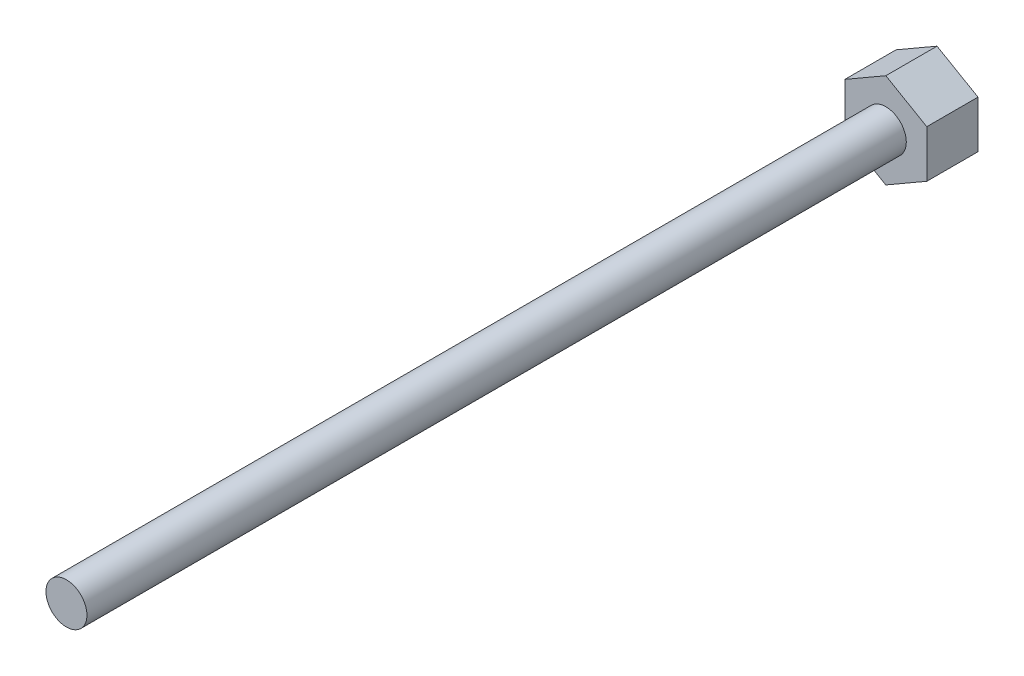
ISO-10303-21;
HEADER;
FILE_DESCRIPTION(('STEP AP214'),'2;1');
FILE_NAME('part.step','',(''),(''),'','','');
FILE_SCHEMA(('AUTOMOTIVE_DESIGN { 1 0 10303 214 1 1 1 1 }'));
ENDSEC;
DATA;
#1=APPLICATION_CONTEXT('core data for automotive mechanical design processes');
#2=APPLICATION_PROTOCOL_DEFINITION('international standard','automotive_design',2000,#1);
#3=PRODUCT_CONTEXT('',#1,'mechanical');
#4=PRODUCT('Part','Part','',(#3));
#5=PRODUCT_RELATED_PRODUCT_CATEGORY('part','',(#4));
#6=PRODUCT_DEFINITION_FORMATION('','',#4);
#7=PRODUCT_DEFINITION_CONTEXT('part definition',#1,'design');
#8=PRODUCT_DEFINITION('design','',#6,#7);
#9=PRODUCT_DEFINITION_SHAPE('','',#8);
#10=(LENGTH_UNIT() NAMED_UNIT(*) SI_UNIT(.MILLI.,.METRE.));
#11=(NAMED_UNIT(*) PLANE_ANGLE_UNIT() SI_UNIT($,.RADIAN.));
#12=(NAMED_UNIT(*) SI_UNIT($,.STERADIAN.) SOLID_ANGLE_UNIT());
#13=UNCERTAINTY_MEASURE_WITH_UNIT(LENGTH_MEASURE(1.E-05),#10,'distance_accuracy_value','');
#14=(GEOMETRIC_REPRESENTATION_CONTEXT(3) GLOBAL_UNCERTAINTY_ASSIGNED_CONTEXT((#13)) GLOBAL_UNIT_ASSIGNED_CONTEXT((#10,
#11,#12)) REPRESENTATION_CONTEXT('',''));
#15=CARTESIAN_POINT('',(0.,0.,0.));
#16=DIRECTION('',(0.,0.,1.));
#17=DIRECTION('',(1.,0.,0.));
#18=AXIS2_PLACEMENT_3D('',#15,#16,#17);
#19=CARTESIAN_POINT('',(0.,0.,80.));
#20=DIRECTION('',(0.,0.,-1.));
#21=DIRECTION('',(-1.,0.,0.));
#22=AXIS2_PLACEMENT_3D('',#19,#20,#21);
#23=CYLINDRICAL_SURFACE('',#22,2.);
#24=CARTESIAN_POINT('',(0.,0.,80.));
#25=DIRECTION('',(0.,0.,1.));
#26=DIRECTION('',(1.,0.,0.));
#27=AXIS2_PLACEMENT_3D('',#24,#25,#26);
#28=CIRCLE('',#27,2.);
#29=CARTESIAN_POINT('',(2.,0.,80.));
#30=VERTEX_POINT('',#29);
#31=EDGE_CURVE('E11',#30,#30,#28,.T.);
#32=ORIENTED_EDGE('',*,*,#31,.F.);
#33=EDGE_LOOP('',(#32));
#34=FACE_BOUND('',#33,.T.);
#35=CARTESIAN_POINT('',(0.,0.,0.));
#36=DIRECTION('',(0.,0.,1.));
#37=DIRECTION('',(1.,0.,0.));
#38=AXIS2_PLACEMENT_3D('',#35,#36,#37);
#39=CIRCLE('',#38,2.);
#40=CARTESIAN_POINT('',(2.,0.,0.));
#41=VERTEX_POINT('',#40);
#42=EDGE_CURVE('E42',#41,#41,#39,.T.);
#43=ORIENTED_EDGE('',*,*,#42,.T.);
#44=EDGE_LOOP('',(#43));
#45=FACE_BOUND('',#44,.T.);
#46=ADVANCED_FACE('F39',(#34,#45),#23,.T.);
#47=CARTESIAN_POINT('',(0.,0.,80.));
#48=DIRECTION('',(0.,0.,1.));
#49=DIRECTION('',(1.,0.,0.));
#50=AXIS2_PLACEMENT_3D('',#47,#48,#49);
#51=PLANE('',#50);
#52=ORIENTED_EDGE('',*,*,#31,.T.);
#53=EDGE_LOOP('',(#52));
#54=FACE_BOUND('',#53,.T.);
#55=ADVANCED_FACE('F183',(#54),#51,.T.);
#56=CARTESIAN_POINT('',(-4.,2.3094010767585,-5.));
#57=DIRECTION('',(0.5,-0.866025403784439,0.));
#58=DIRECTION('',(0.866025403784439,0.5,0.));
#59=AXIS2_PLACEMENT_3D('',#56,#57,#58);
#60=PLANE('',#59);
#61=DIRECTION('',(0.866025403784439,0.5,0.));
#62=VECTOR('',#61,1.);
#63=CARTESIAN_POINT('',(-4.,2.3094010767585,0.));
#64=LINE('',#63,#62);
#65=CARTESIAN_POINT('',(-4.,2.3094010767585,0.));
#66=VERTEX_POINT('',#65);
#67=CARTESIAN_POINT('',(0.,4.61880215351701,0.));
#68=VERTEX_POINT('',#67);
#69=EDGE_CURVE('E129',#66,#68,#64,.T.);
#70=ORIENTED_EDGE('',*,*,#69,.T.);
#71=DIRECTION('',(0.,0.,1.));
#72=VECTOR('',#71,1.);
#73=CARTESIAN_POINT('',(0.,4.61880215351701,-5.));
#74=LINE('',#73,#72);
#75=CARTESIAN_POINT('',(0.,4.61880215351701,-5.));
#76=VERTEX_POINT('',#75);
#77=EDGE_CURVE('E156',#76,#68,#74,.T.);
#78=ORIENTED_EDGE('',*,*,#77,.F.);
#79=DIRECTION('',(0.866025403784439,0.5,0.));
#80=VECTOR('',#79,1.);
#81=CARTESIAN_POINT('',(-4.,2.3094010767585,-5.));
#82=LINE('',#81,#80);
#83=CARTESIAN_POINT('',(-4.,2.3094010767585,-5.));
#84=VERTEX_POINT('',#83);
#85=EDGE_CURVE('E145',#84,#76,#82,.T.);
#86=ORIENTED_EDGE('',*,*,#85,.F.);
#87=DIRECTION('',(0.,0.,1.));
#88=VECTOR('',#87,1.);
#89=CARTESIAN_POINT('',(-4.,2.3094010767585,-5.));
#90=LINE('',#89,#88);
#91=EDGE_CURVE('E125',#84,#66,#90,.T.);
#92=ORIENTED_EDGE('',*,*,#91,.T.);
#93=EDGE_LOOP('',(#70,#78,#86,#92));
#94=FACE_BOUND('',#93,.T.);
#95=ADVANCED_FACE('F171',(#94),#60,.F.);
#96=CARTESIAN_POINT('',(0.,4.61880215351701,-5.));
#97=DIRECTION('',(-0.5,-0.866025403784439,0.));
#98=DIRECTION('',(0.866025403784439,-0.5,0.));
#99=AXIS2_PLACEMENT_3D('',#96,#97,#98);
#100=PLANE('',#99);
#101=DIRECTION('',(0.866025403784439,-0.5,0.));
#102=VECTOR('',#101,1.);
#103=CARTESIAN_POINT('',(0.,4.61880215351701,0.));
#104=LINE('',#103,#102);
#105=CARTESIAN_POINT('',(4.,2.3094010767585,0.));
#106=VERTEX_POINT('',#105);
#107=EDGE_CURVE('E133',#68,#106,#104,.T.);
#108=ORIENTED_EDGE('',*,*,#107,.T.);
#109=DIRECTION('',(0.,0.,1.));
#110=VECTOR('',#109,1.);
#111=CARTESIAN_POINT('',(4.,2.3094010767585,-5.));
#112=LINE('',#111,#110);
#113=CARTESIAN_POINT('',(4.,2.3094010767585,-5.));
#114=VERTEX_POINT('',#113);
#115=EDGE_CURVE('E152',#114,#106,#112,.T.);
#116=ORIENTED_EDGE('',*,*,#115,.F.);
#117=DIRECTION('',(0.866025403784439,-0.5,0.));
#118=VECTOR('',#117,1.);
#119=CARTESIAN_POINT('',(0.,4.61880215351701,-5.));
#120=LINE('',#119,#118);
#121=EDGE_CURVE('E94',#76,#114,#120,.T.);
#122=ORIENTED_EDGE('',*,*,#121,.F.);
#123=ORIENTED_EDGE('',*,*,#77,.T.);
#124=EDGE_LOOP('',(#108,#116,#122,#123));
#125=FACE_BOUND('',#124,.T.);
#126=ADVANCED_FACE('F193',(#125),#100,.F.);
#127=CARTESIAN_POINT('',(4.,2.3094010767585,-5.));
#128=DIRECTION('',(-1.,0.,0.));
#129=DIRECTION('',(0.,0.,1.));
#130=AXIS2_PLACEMENT_3D('',#127,#128,#129);
#131=PLANE('',#130);
#132=DIRECTION('',(0.,-1.,0.));
#133=VECTOR('',#132,1.);
#134=CARTESIAN_POINT('',(4.,2.3094010767585,0.));
#135=LINE('',#134,#133);
#136=CARTESIAN_POINT('',(4.,-2.3094010767585,0.));
#137=VERTEX_POINT('',#136);
#138=EDGE_CURVE('E136',#106,#137,#135,.T.);
#139=ORIENTED_EDGE('',*,*,#138,.T.);
#140=DIRECTION('',(0.,0.,1.));
#141=VECTOR('',#140,1.);
#142=CARTESIAN_POINT('',(4.,-2.3094010767585,-5.));
#143=LINE('',#142,#141);
#144=CARTESIAN_POINT('',(4.,-2.3094010767585,-5.));
#145=VERTEX_POINT('',#144);
#146=EDGE_CURVE('E118',#145,#137,#143,.T.);
#147=ORIENTED_EDGE('',*,*,#146,.F.);
#148=DIRECTION('',(0.,-1.,0.));
#149=VECTOR('',#148,1.);
#150=CARTESIAN_POINT('',(4.,2.3094010767585,-5.));
#151=LINE('',#150,#149);
#152=EDGE_CURVE('E107',#114,#145,#151,.T.);
#153=ORIENTED_EDGE('',*,*,#152,.F.);
#154=ORIENTED_EDGE('',*,*,#115,.T.);
#155=EDGE_LOOP('',(#139,#147,#153,#154));
#156=FACE_BOUND('',#155,.T.);
#157=ADVANCED_FACE('F198',(#156),#131,.F.);
#158=CARTESIAN_POINT('',(4.,-2.3094010767585,-5.));
#159=DIRECTION('',(-0.5,0.866025403784438,0.));
#160=DIRECTION('',(-0.866025403784439,-0.5,0.));
#161=AXIS2_PLACEMENT_3D('',#158,#159,#160);
#162=PLANE('',#161);
#163=DIRECTION('',(-0.866025403784438,-0.5,0.));
#164=VECTOR('',#163,1.);
#165=CARTESIAN_POINT('',(4.,-2.3094010767585,0.));
#166=LINE('',#165,#164);
#167=CARTESIAN_POINT('',(0.,-4.61880215351701,0.));
#168=VERTEX_POINT('',#167);
#169=EDGE_CURVE('E116',#137,#168,#166,.T.);
#170=ORIENTED_EDGE('',*,*,#169,.T.);
#171=DIRECTION('',(0.,0.,1.));
#172=VECTOR('',#171,1.);
#173=CARTESIAN_POINT('',(0.,-4.61880215351701,-5.));
#174=LINE('',#173,#172);
#175=CARTESIAN_POINT('',(0.,-4.61880215351701,-5.));
#176=VERTEX_POINT('',#175);
#177=EDGE_CURVE('E113',#176,#168,#174,.T.);
#178=ORIENTED_EDGE('',*,*,#177,.F.);
#179=DIRECTION('',(-0.866025403784438,-0.5,0.));
#180=VECTOR('',#179,1.);
#181=CARTESIAN_POINT('',(4.,-2.3094010767585,-5.));
#182=LINE('',#181,#180);
#183=EDGE_CURVE('E101',#145,#176,#182,.T.);
#184=ORIENTED_EDGE('',*,*,#183,.F.);
#185=ORIENTED_EDGE('',*,*,#146,.T.);
#186=EDGE_LOOP('',(#170,#178,#184,#185));
#187=FACE_BOUND('',#186,.T.);
#188=ADVANCED_FACE('F114',(#187),#162,.F.);
#189=CARTESIAN_POINT('',(0.,-4.61880215351701,-5.));
#190=DIRECTION('',(0.5,0.866025403784439,0.));
#191=DIRECTION('',(-0.866025403784439,0.5,0.));
#192=AXIS2_PLACEMENT_3D('',#189,#190,#191);
#193=PLANE('',#192);
#194=DIRECTION('',(-0.866025403784439,0.5,0.));
#195=VECTOR('',#194,1.);
#196=CARTESIAN_POINT('',(0.,-4.61880215351701,0.));
#197=LINE('',#196,#195);
#198=CARTESIAN_POINT('',(-4.,-2.3094010767585,0.));
#199=VERTEX_POINT('',#198);
#200=EDGE_CURVE('E79',#168,#199,#197,.T.);
#201=ORIENTED_EDGE('',*,*,#200,.T.);
#202=DIRECTION('',(0.,0.,1.));
#203=VECTOR('',#202,1.);
#204=CARTESIAN_POINT('',(-4.,-2.3094010767585,-5.));
#205=LINE('',#204,#203);
#206=CARTESIAN_POINT('',(-4.,-2.3094010767585,-5.));
#207=VERTEX_POINT('',#206);
#208=EDGE_CURVE('E119',#207,#199,#205,.T.);
#209=ORIENTED_EDGE('',*,*,#208,.F.);
#210=DIRECTION('',(-0.866025403784439,0.5,0.));
#211=VECTOR('',#210,1.);
#212=CARTESIAN_POINT('',(0.,-4.61880215351701,-5.));
#213=LINE('',#212,#211);
#214=EDGE_CURVE('E105',#176,#207,#213,.T.);
#215=ORIENTED_EDGE('',*,*,#214,.F.);
#216=ORIENTED_EDGE('',*,*,#177,.T.);
#217=EDGE_LOOP('',(#201,#209,#215,#216));
#218=FACE_BOUND('',#217,.T.);
#219=ADVANCED_FACE('F121',(#218),#193,.F.);
#220=CARTESIAN_POINT('',(-4.,-2.3094010767585,-5.));
#221=DIRECTION('',(1.,0.,0.));
#222=DIRECTION('',(0.,0.,-1.));
#223=AXIS2_PLACEMENT_3D('',#220,#221,#222);
#224=PLANE('',#223);
#225=DIRECTION('',(0.,1.,0.));
#226=VECTOR('',#225,1.);
#227=CARTESIAN_POINT('',(-4.,-2.3094010767585,0.));
#228=LINE('',#227,#226);
#229=EDGE_CURVE('E85',#199,#66,#228,.T.);
#230=ORIENTED_EDGE('',*,*,#229,.T.);
#231=ORIENTED_EDGE('',*,*,#91,.F.);
#232=DIRECTION('',(0.,1.,0.));
#233=VECTOR('',#232,1.);
#234=CARTESIAN_POINT('',(-4.,-2.3094010767585,-5.));
#235=LINE('',#234,#233);
#236=EDGE_CURVE('E56',#207,#84,#235,.T.);
#237=ORIENTED_EDGE('',*,*,#236,.F.);
#238=ORIENTED_EDGE('',*,*,#208,.T.);
#239=EDGE_LOOP('',(#230,#231,#237,#238));
#240=FACE_BOUND('',#239,.T.);
#241=ADVANCED_FACE('F173',(#240),#224,.F.);
#242=CARTESIAN_POINT('',(0.,0.,-5.));
#243=DIRECTION('',(0.,0.,-1.));
#244=DIRECTION('',(-1.,0.,0.));
#245=AXIS2_PLACEMENT_3D('',#242,#243,#244);
#246=PLANE('',#245);
#247=ORIENTED_EDGE('',*,*,#85,.T.);
#248=ORIENTED_EDGE('',*,*,#121,.T.);
#249=ORIENTED_EDGE('',*,*,#152,.T.);
#250=ORIENTED_EDGE('',*,*,#183,.T.);
#251=ORIENTED_EDGE('',*,*,#214,.T.);
#252=ORIENTED_EDGE('',*,*,#236,.T.);
#253=EDGE_LOOP('',(#247,#248,#249,#250,#251,#252));
#254=FACE_BOUND('',#253,.T.);
#255=ADVANCED_FACE('F103',(#254),#246,.T.);
#256=CARTESIAN_POINT('',(0.,0.,0.));
#257=DIRECTION('',(0.,0.,-1.));
#258=DIRECTION('',(-1.,0.,0.));
#259=AXIS2_PLACEMENT_3D('',#256,#257,#258);
#260=PLANE('',#259);
#261=ORIENTED_EDGE('',*,*,#42,.F.);
#262=EDGE_LOOP('',(#261));
#263=FACE_BOUND('',#262,.T.);
#264=ORIENTED_EDGE('',*,*,#69,.F.);
#265=ORIENTED_EDGE('',*,*,#229,.F.);
#266=ORIENTED_EDGE('',*,*,#200,.F.);
#267=ORIENTED_EDGE('',*,*,#169,.F.);
#268=ORIENTED_EDGE('',*,*,#138,.F.);
#269=ORIENTED_EDGE('',*,*,#107,.F.);
#270=EDGE_LOOP('',(#264,#265,#266,#267,#268,#269));
#271=FACE_BOUND('',#270,.T.);
#272=ADVANCED_FACE('F164',(#263,#271),#260,.F.);
#273=CLOSED_SHELL('',(#46,#55,#95,#126,#157,#188,#219,#241,#255,#272));
#274=MANIFOLD_SOLID_BREP('B2',#273);
#275=ADVANCED_BREP_SHAPE_REPRESENTATION('',(#18,#274),#14);
#276=SHAPE_DEFINITION_REPRESENTATION(#9,#275);
ENDSEC;
END-ISO-10303-21;
